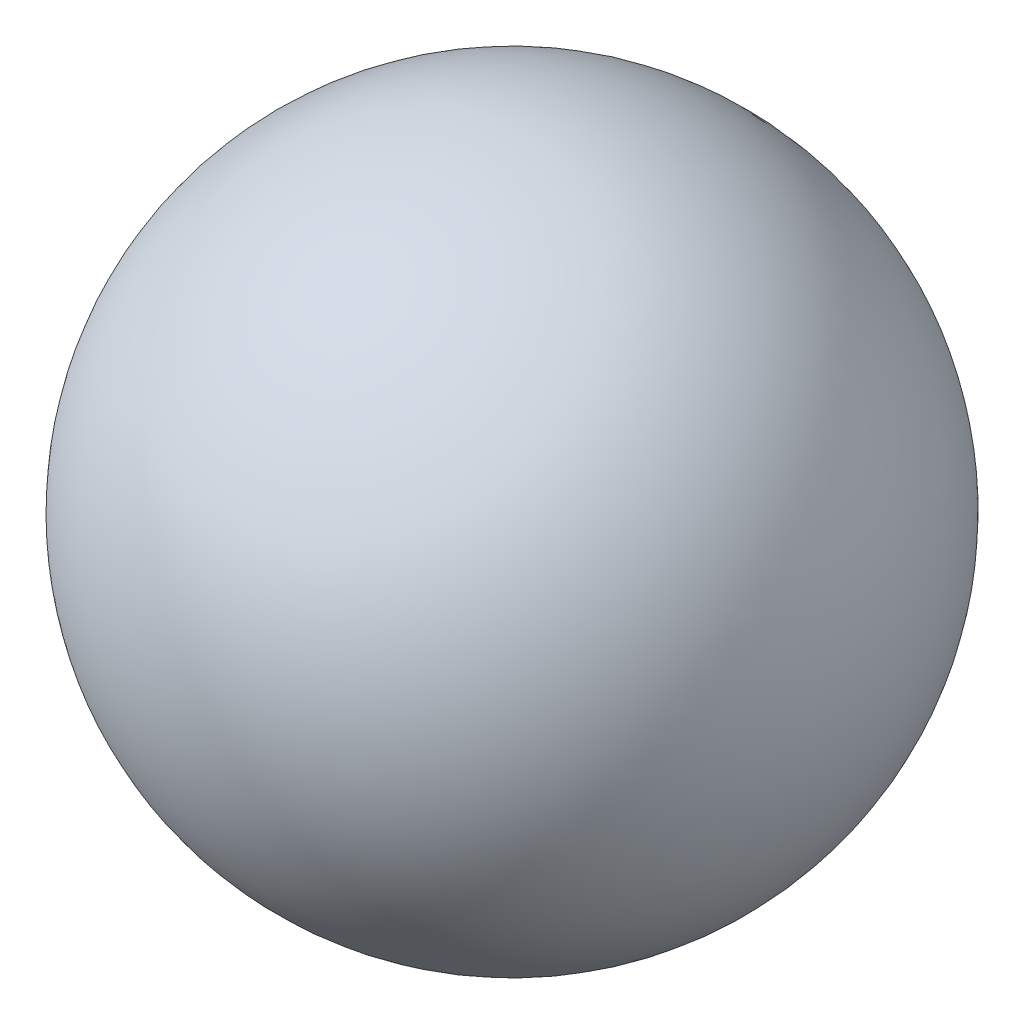
ISO-10303-21;
HEADER;
FILE_DESCRIPTION(('STEP AP214'),'2;1');
FILE_NAME('part.step','',(''),(''),'','','');
FILE_SCHEMA(('AUTOMOTIVE_DESIGN { 1 0 10303 214 1 1 1 1 }'));
ENDSEC;
DATA;
#1=APPLICATION_CONTEXT('core data for automotive mechanical design processes');
#2=APPLICATION_PROTOCOL_DEFINITION('international standard','automotive_design',2000,#1);
#3=PRODUCT_CONTEXT('',#1,'mechanical');
#4=PRODUCT('Part','Part','',(#3));
#5=PRODUCT_RELATED_PRODUCT_CATEGORY('part','',(#4));
#6=PRODUCT_DEFINITION_FORMATION('','',#4);
#7=PRODUCT_DEFINITION_CONTEXT('part definition',#1,'design');
#8=PRODUCT_DEFINITION('design','',#6,#7);
#9=PRODUCT_DEFINITION_SHAPE('','',#8);
#10=(LENGTH_UNIT() NAMED_UNIT(*) SI_UNIT(.MILLI.,.METRE.));
#11=(NAMED_UNIT(*) PLANE_ANGLE_UNIT() SI_UNIT($,.RADIAN.));
#12=(NAMED_UNIT(*) SI_UNIT($,.STERADIAN.) SOLID_ANGLE_UNIT());
#13=UNCERTAINTY_MEASURE_WITH_UNIT(LENGTH_MEASURE(1.E-05),#10,'distance_accuracy_value','');
#14=(GEOMETRIC_REPRESENTATION_CONTEXT(3) GLOBAL_UNCERTAINTY_ASSIGNED_CONTEXT((#13)) GLOBAL_UNIT_ASSIGNED_CONTEXT((#10,
#11,#12)) REPRESENTATION_CONTEXT('',''));
#15=CARTESIAN_POINT('',(0.,0.,0.));
#16=DIRECTION('',(0.,0.,1.));
#17=DIRECTION('',(1.,0.,0.));
#18=AXIS2_PLACEMENT_3D('',#15,#16,#17);
#19=CARTESIAN_POINT('',(64.16,-18.1355759759196,-66.9709009422876));
#20=DIRECTION('',(0.,-0.261383566232647,-0.965235013508895));
#21=DIRECTION('',(0.173648177666934,0.950570924782396,-0.257412562535888));
#22=AXIS2_PLACEMENT_3D('',#19,#20,#21);
#23=SPHERICAL_SURFACE('',#22,7.15);
#24=CARTESIAN_POINT('',(64.16,-16.2666834773562,-60.0694705956991));
#25=VERTEX_POINT('',#24);
#26=VERTEX_LOOP('',#25);
#27=FACE_BOUND('',#26,.T.);
#28=CARTESIAN_POINT('',(64.16,-20.004468474483,-73.8723312888762));
#29=VERTEX_POINT('',#28);
#30=VERTEX_LOOP('',#29);
#31=FACE_BOUND('',#30,.T.);
#32=ADVANCED_FACE('F23',(#27,#31),#23,.T.);
#33=CLOSED_SHELL('',(#32));
#34=MANIFOLD_SOLID_BREP('B1',#33);
#35=ADVANCED_BREP_SHAPE_REPRESENTATION('',(#18,#34),#14);
#36=SHAPE_DEFINITION_REPRESENTATION(#9,#35);
ENDSEC;
END-ISO-10303-21;
